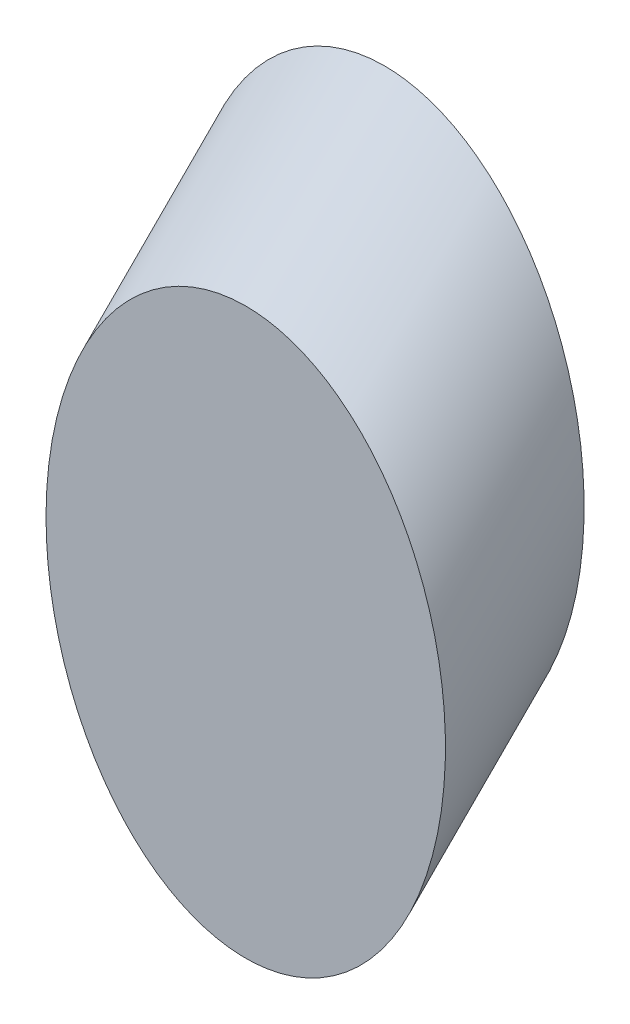
ISO-10303-21;
HEADER;
FILE_DESCRIPTION(('STEP AP214'),'2;1');
FILE_NAME('part.step','',(''),(''),'','','');
FILE_SCHEMA(('AUTOMOTIVE_DESIGN { 1 0 10303 214 1 1 1 1 }'));
ENDSEC;
DATA;
#1=APPLICATION_CONTEXT('core data for automotive mechanical design processes');
#2=APPLICATION_PROTOCOL_DEFINITION('international standard','automotive_design',2000,#1);
#3=PRODUCT_CONTEXT('',#1,'mechanical');
#4=PRODUCT('Part','Part','',(#3));
#5=PRODUCT_RELATED_PRODUCT_CATEGORY('part','',(#4));
#6=PRODUCT_DEFINITION_FORMATION('','',#4);
#7=PRODUCT_DEFINITION_CONTEXT('part definition',#1,'design');
#8=PRODUCT_DEFINITION('design','',#6,#7);
#9=PRODUCT_DEFINITION_SHAPE('','',#8);
#10=(LENGTH_UNIT() NAMED_UNIT(*) SI_UNIT(.MILLI.,.METRE.));
#11=(NAMED_UNIT(*) PLANE_ANGLE_UNIT() SI_UNIT($,.RADIAN.));
#12=(NAMED_UNIT(*) SI_UNIT($,.STERADIAN.) SOLID_ANGLE_UNIT());
#13=UNCERTAINTY_MEASURE_WITH_UNIT(LENGTH_MEASURE(1.E-05),#10,'distance_accuracy_value','');
#14=(GEOMETRIC_REPRESENTATION_CONTEXT(3) GLOBAL_UNCERTAINTY_ASSIGNED_CONTEXT((#13)) GLOBAL_UNIT_ASSIGNED_CONTEXT((#10,
#11,#12)) REPRESENTATION_CONTEXT('',''));
#15=CARTESIAN_POINT('',(0.,0.,0.));
#16=DIRECTION('',(0.,0.,1.));
#17=DIRECTION('',(1.,0.,0.));
#18=AXIS2_PLACEMENT_3D('',#15,#16,#17);
#19=CARTESIAN_POINT('',(54.3923829817161,48.2891052081379,-12.5002336778158));
#20=DIRECTION('',(0.,0.,1.));
#21=DIRECTION('',(0.,1.,0.));
#22=AXIS2_PLACEMENT_3D('',#19,#20,#21);
#23=ELLIPSE('',#22,25.46,18.);
#24=DIRECTION('',(0.,-0.707106781186549,0.707106781186546));
#25=VECTOR('',#24,1.);
#26=SURFACE_OF_LINEAR_EXTRUSION('',#23,#25);
#27=CARTESIAN_POINT('',(54.3923829817161,73.7491052081379,-12.5002336778158));
#28=VERTEX_POINT('',#27);
#29=EDGE_CURVE('E10',#28,#28,#23,.T.);
#30=ORIENTED_EDGE('',*,*,#29,.T.);
#31=EDGE_LOOP('',(#30));
#32=FACE_BOUND('',#31,.T.);
#33=CARTESIAN_POINT('',(54.3923829817161,35.7888715303221,0.));
#34=DIRECTION('',(0.,0.,1.));
#35=DIRECTION('',(0.,1.,0.));
#36=AXIS2_PLACEMENT_3D('',#33,#34,#35);
#37=ELLIPSE('',#36,25.46,18.);
#38=CARTESIAN_POINT('',(54.3923829817161,61.2488715303221,0.));
#39=VERTEX_POINT('',#38);
#40=EDGE_CURVE('E39',#39,#39,#37,.T.);
#41=ORIENTED_EDGE('',*,*,#40,.F.);
#42=EDGE_LOOP('',(#41));
#43=FACE_BOUND('',#42,.T.);
#44=ADVANCED_FACE('F35',(#32,#43),#26,.T.);
#45=CARTESIAN_POINT('',(54.3923829817161,48.2891052081379,-12.5002336778158));
#46=DIRECTION('',(0.,0.,1.));
#47=DIRECTION('',(1.,0.,0.));
#48=AXIS2_PLACEMENT_3D('',#45,#46,#47);
#49=PLANE('',#48);
#50=ORIENTED_EDGE('',*,*,#29,.F.);
#51=EDGE_LOOP('',(#50));
#52=FACE_BOUND('',#51,.T.);
#53=ADVANCED_FACE('F51',(#52),#49,.F.);
#54=CARTESIAN_POINT('',(54.3923829817161,35.7888715303221,0.));
#55=DIRECTION('',(0.,0.,1.));
#56=DIRECTION('',(1.,0.,0.));
#57=AXIS2_PLACEMENT_3D('',#54,#55,#56);
#58=PLANE('',#57);
#59=ORIENTED_EDGE('',*,*,#40,.T.);
#60=EDGE_LOOP('',(#59));
#61=FACE_BOUND('',#60,.T.);
#62=ADVANCED_FACE('F48',(#61),#58,.T.);
#63=CLOSED_SHELL('',(#44,#53,#62));
#64=MANIFOLD_SOLID_BREP('B2',#63);
#65=ADVANCED_BREP_SHAPE_REPRESENTATION('',(#18,#64),#14);
#66=SHAPE_DEFINITION_REPRESENTATION(#9,#65);
ENDSEC;
END-ISO-10303-21;
